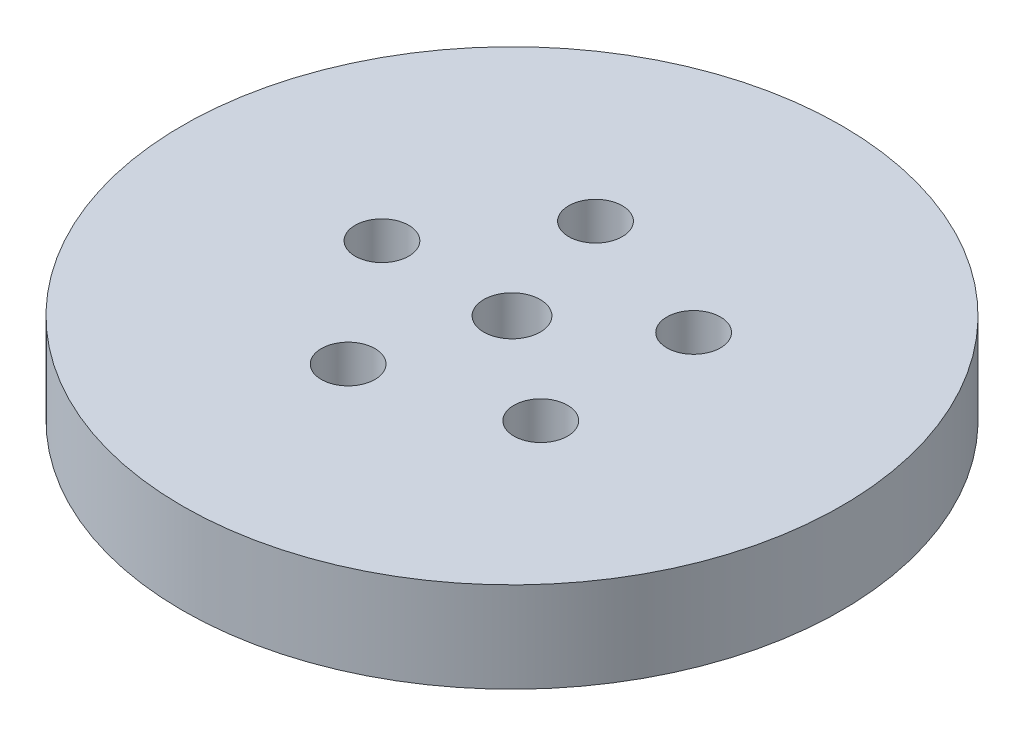
ISO-10303-21;
HEADER;
FILE_DESCRIPTION(('STEP AP214'),'2;1');
FILE_NAME('part.step','',(''),(''),'','','');
FILE_SCHEMA(('AUTOMOTIVE_DESIGN { 1 0 10303 214 1 1 1 1 }'));
ENDSEC;
DATA;
#1=APPLICATION_CONTEXT('core data for automotive mechanical design processes');
#2=APPLICATION_PROTOCOL_DEFINITION('international standard','automotive_design',2000,#1);
#3=PRODUCT_CONTEXT('',#1,'mechanical');
#4=PRODUCT('Part','Part','',(#3));
#5=PRODUCT_RELATED_PRODUCT_CATEGORY('part','',(#4));
#6=PRODUCT_DEFINITION_FORMATION('','',#4);
#7=PRODUCT_DEFINITION_CONTEXT('part definition',#1,'design');
#8=PRODUCT_DEFINITION('design','',#6,#7);
#9=PRODUCT_DEFINITION_SHAPE('','',#8);
#10=(LENGTH_UNIT() NAMED_UNIT(*) SI_UNIT(.MILLI.,.METRE.));
#11=(NAMED_UNIT(*) PLANE_ANGLE_UNIT() SI_UNIT($,.RADIAN.));
#12=(NAMED_UNIT(*) SI_UNIT($,.STERADIAN.) SOLID_ANGLE_UNIT());
#13=UNCERTAINTY_MEASURE_WITH_UNIT(LENGTH_MEASURE(1.E-05),#10,'distance_accuracy_value','');
#14=(GEOMETRIC_REPRESENTATION_CONTEXT(3) GLOBAL_UNCERTAINTY_ASSIGNED_CONTEXT((#13)) GLOBAL_UNIT_ASSIGNED_CONTEXT((#10,
#11,#12)) REPRESENTATION_CONTEXT('',''));
#15=CARTESIAN_POINT('',(0.,0.,0.));
#16=DIRECTION('',(0.,0.,1.));
#17=DIRECTION('',(1.,0.,0.));
#18=AXIS2_PLACEMENT_3D('',#15,#16,#17);
#19=CARTESIAN_POINT('',(0.,24.,0.));
#20=DIRECTION('',(0.,-1.,0.));
#21=DIRECTION('',(0.,0.,-1.));
#22=AXIS2_PLACEMENT_3D('',#19,#20,#21);
#23=CYLINDRICAL_SURFACE('',#22,87.5);
#24=CARTESIAN_POINT('',(0.,24.,0.));
#25=DIRECTION('',(0.,1.,0.));
#26=DIRECTION('',(0.,0.,1.));
#27=AXIS2_PLACEMENT_3D('',#24,#25,#26);
#28=CIRCLE('',#27,87.5);
#29=CARTESIAN_POINT('',(0.,24.,87.5));
#30=VERTEX_POINT('',#29);
#31=EDGE_CURVE('E10',#30,#30,#28,.T.);
#32=ORIENTED_EDGE('',*,*,#31,.F.);
#33=EDGE_LOOP('',(#32));
#34=FACE_BOUND('',#33,.T.);
#35=CARTESIAN_POINT('',(0.,0.,0.));
#36=DIRECTION('',(0.,1.,0.));
#37=DIRECTION('',(0.,0.,1.));
#38=AXIS2_PLACEMENT_3D('',#35,#36,#37);
#39=CIRCLE('',#38,87.5);
#40=CARTESIAN_POINT('',(0.,0.,87.5));
#41=VERTEX_POINT('',#40);
#42=EDGE_CURVE('E37',#41,#41,#39,.T.);
#43=ORIENTED_EDGE('',*,*,#42,.T.);
#44=EDGE_LOOP('',(#43));
#45=FACE_BOUND('',#44,.T.);
#46=ADVANCED_FACE('F40',(#34,#45),#23,.T.);
#47=CARTESIAN_POINT('',(0.,24.,0.));
#48=DIRECTION('',(0.,1.,0.));
#49=DIRECTION('',(0.,0.,1.));
#50=AXIS2_PLACEMENT_3D('',#47,#48,#49);
#51=PLANE('',#50);
#52=CARTESIAN_POINT('',(-10.6700276352967,24.,-32.8389683943563));
#53=DIRECTION('',(0.,1.,0.));
#54=DIRECTION('',(-0.95105651629515,0.,0.309016994374958));
#55=AXIS2_PLACEMENT_3D('',#52,#53,#54);
#56=CIRCLE('',#55,7.1207078960949);
#57=CARTESIAN_POINT('',(-17.442223280512,24.,-30.638548642483));
#58=VERTEX_POINT('',#57);
#59=EDGE_CURVE('E70',#58,#58,#56,.T.);
#60=ORIENTED_EDGE('',*,*,#59,.F.);
#61=EDGE_LOOP('',(#60));
#62=FACE_BOUND('',#61,.T.);
#63=CARTESIAN_POINT('',(27.9344950101062,24.,-20.2955986231961));
#64=DIRECTION('',(0.,1.,0.));
#65=DIRECTION('',(-0.58778525229248,0.,-0.809016994374942));
#66=AXIS2_PLACEMENT_3D('',#63,#64,#65);
#67=CIRCLE('',#66,7.1207078960949);
#68=CARTESIAN_POINT('',(23.749047922899,24.,-26.0563723231167));
#69=VERTEX_POINT('',#68);
#70=EDGE_CURVE('E71',#69,#69,#67,.T.);
#71=ORIENTED_EDGE('',*,*,#70,.F.);
#72=EDGE_LOOP('',(#71));
#73=FACE_BOUND('',#72,.T.);
#74=CARTESIAN_POINT('',(27.9344950101065,24.,20.2955986231957));
#75=DIRECTION('',(0.,1.,0.));
#76=DIRECTION('',(0.587785252292469,0.,-0.809016994374951));
#77=AXIS2_PLACEMENT_3D('',#74,#75,#76);
#78=CIRCLE('',#77,7.1207078960949);
#79=CARTESIAN_POINT('',(32.1199420973136,24.,14.534824923275));
#80=VERTEX_POINT('',#79);
#81=EDGE_CURVE('E78',#80,#80,#78,.T.);
#82=ORIENTED_EDGE('',*,*,#81,.F.);
#83=EDGE_LOOP('',(#82));
#84=FACE_BOUND('',#83,.T.);
#85=CARTESIAN_POINT('',(-10.6700276352962,24.,32.8389683943564));
#86=DIRECTION('',(0.,1.,0.));
#87=DIRECTION('',(0.951056516295155,0.,0.309016994374945));
#88=AXIS2_PLACEMENT_3D('',#85,#86,#87);
#89=CIRCLE('',#88,7.1207078960949);
#90=CARTESIAN_POINT('',(-3.89783199008079,24.,35.0393881462296));
#91=VERTEX_POINT('',#90);
#92=EDGE_CURVE('E61',#91,#91,#89,.T.);
#93=ORIENTED_EDGE('',*,*,#92,.F.);
#94=EDGE_LOOP('',(#93));
#95=FACE_BOUND('',#94,.T.);
#96=CARTESIAN_POINT('',(-34.5289347496201,24.,0.));
#97=DIRECTION('',(0.,1.,0.));
#98=DIRECTION('',(0.,0.,1.));
#99=AXIS2_PLACEMENT_3D('',#96,#97,#98);
#100=CIRCLE('',#99,7.1207078960949);
#101=CARTESIAN_POINT('',(-34.5289347496201,24.,7.1207078960949));
#102=VERTEX_POINT('',#101);
#103=EDGE_CURVE('E54',#102,#102,#100,.T.);
#104=ORIENTED_EDGE('',*,*,#103,.F.);
#105=EDGE_LOOP('',(#104));
#106=FACE_BOUND('',#105,.T.);
#107=CARTESIAN_POINT('',(0.,24.,0.));
#108=DIRECTION('',(0.,1.,0.));
#109=DIRECTION('',(0.,0.,1.));
#110=AXIS2_PLACEMENT_3D('',#107,#108,#109);
#111=CIRCLE('',#110,7.5);
#112=CARTESIAN_POINT('',(0.,24.,7.5));
#113=VERTEX_POINT('',#112);
#114=EDGE_CURVE('E50',#113,#113,#111,.T.);
#115=ORIENTED_EDGE('',*,*,#114,.F.);
#116=EDGE_LOOP('',(#115));
#117=FACE_BOUND('',#116,.T.);
#118=ORIENTED_EDGE('',*,*,#31,.T.);
#119=EDGE_LOOP('',(#118));
#120=FACE_BOUND('',#119,.T.);
#121=ADVANCED_FACE('F94',(#62,#73,#84,#95,#106,#117,#120),#51,.T.);
#122=CARTESIAN_POINT('',(0.,0.,0.));
#123=DIRECTION('',(0.,1.,0.));
#124=DIRECTION('',(0.,0.,1.));
#125=AXIS2_PLACEMENT_3D('',#122,#123,#124);
#126=PLANE('',#125);
#127=CARTESIAN_POINT('',(0.,0.,0.));
#128=DIRECTION('',(0.,1.,0.));
#129=DIRECTION('',(0.,0.,1.));
#130=AXIS2_PLACEMENT_3D('',#127,#128,#129);
#131=CIRCLE('',#130,7.5);
#132=CARTESIAN_POINT('',(0.,0.,7.5));
#133=VERTEX_POINT('',#132);
#134=EDGE_CURVE('E47',#133,#133,#131,.T.);
#135=ORIENTED_EDGE('',*,*,#134,.T.);
#136=EDGE_LOOP('',(#135));
#137=FACE_BOUND('',#136,.T.);
#138=ORIENTED_EDGE('',*,*,#42,.F.);
#139=EDGE_LOOP('',(#138));
#140=FACE_BOUND('',#139,.T.);
#141=ADVANCED_FACE('F100',(#137,#140),#126,.F.);
#142=CARTESIAN_POINT('',(0.,24.,0.));
#143=DIRECTION('',(0.,-1.,0.));
#144=DIRECTION('',(0.,0.,-1.));
#145=AXIS2_PLACEMENT_3D('',#142,#143,#144);
#146=CYLINDRICAL_SURFACE('',#145,7.5);
#147=ORIENTED_EDGE('',*,*,#114,.T.);
#148=EDGE_LOOP('',(#147));
#149=FACE_BOUND('',#148,.T.);
#150=ORIENTED_EDGE('',*,*,#134,.F.);
#151=EDGE_LOOP('',(#150));
#152=FACE_BOUND('',#151,.T.);
#153=ADVANCED_FACE('F106',(#149,#152),#146,.F.);
#154=CARTESIAN_POINT('',(-34.5289347496201,1.681451558427,0.));
#155=DIRECTION('',(0.,1.,0.));
#156=DIRECTION('',(0.,0.,1.));
#157=AXIS2_PLACEMENT_3D('',#154,#155,#156);
#158=CYLINDRICAL_SURFACE('',#157,7.1207078960949);
#159=CARTESIAN_POINT('',(-34.5289347496201,1.681451558427,0.));
#160=DIRECTION('',(0.,1.,0.));
#161=DIRECTION('',(0.,0.,1.));
#162=AXIS2_PLACEMENT_3D('',#159,#160,#161);
#163=CIRCLE('',#162,7.1207078960949);
#164=CARTESIAN_POINT('',(-34.5289347496201,1.681451558427,7.1207078960949));
#165=VERTEX_POINT('',#164);
#166=EDGE_CURVE('E55',#165,#165,#163,.T.);
#167=ORIENTED_EDGE('',*,*,#166,.F.);
#168=EDGE_LOOP('',(#167));
#169=FACE_BOUND('',#168,.T.);
#170=ORIENTED_EDGE('',*,*,#103,.T.);
#171=EDGE_LOOP('',(#170));
#172=FACE_BOUND('',#171,.T.);
#173=ADVANCED_FACE('F108',(#169,#172),#158,.F.);
#174=CARTESIAN_POINT('',(-34.5289347496201,1.681451558427,0.));
#175=DIRECTION('',(0.,1.,0.));
#176=DIRECTION('',(0.,0.,1.));
#177=AXIS2_PLACEMENT_3D('',#174,#175,#176);
#178=PLANE('',#177);
#179=ORIENTED_EDGE('',*,*,#166,.T.);
#180=EDGE_LOOP('',(#179));
#181=FACE_BOUND('',#180,.T.);
#182=ADVANCED_FACE('F138',(#181),#178,.T.);
#183=CARTESIAN_POINT('',(-10.6700276352962,1.681451558427,32.8389683943564));
#184=DIRECTION('',(0.,1.,0.));
#185=DIRECTION('',(0.,0.,1.));
#186=AXIS2_PLACEMENT_3D('',#183,#184,#185);
#187=CYLINDRICAL_SURFACE('',#186,7.1207078960949);
#188=CARTESIAN_POINT('',(-10.6700276352962,1.681451558427,32.8389683943564));
#189=DIRECTION('',(0.,1.,0.));
#190=DIRECTION('',(0.951056516295155,0.,0.309016994374945));
#191=AXIS2_PLACEMENT_3D('',#188,#189,#190);
#192=CIRCLE('',#191,7.1207078960949);
#193=CARTESIAN_POINT('',(-3.89783199008079,1.681451558427,35.0393881462296));
#194=VERTEX_POINT('',#193);
#195=EDGE_CURVE('E59',#194,#194,#192,.T.);
#196=ORIENTED_EDGE('',*,*,#195,.F.);
#197=EDGE_LOOP('',(#196));
#198=FACE_BOUND('',#197,.T.);
#199=ORIENTED_EDGE('',*,*,#92,.T.);
#200=EDGE_LOOP('',(#199));
#201=FACE_BOUND('',#200,.T.);
#202=ADVANCED_FACE('F150',(#198,#201),#187,.F.);
#203=CARTESIAN_POINT('',(-10.6700276352962,1.681451558427,32.8389683943564));
#204=DIRECTION('',(0.,1.,0.));
#205=DIRECTION('',(0.951056516295155,0.,0.309016994374945));
#206=AXIS2_PLACEMENT_3D('',#203,#204,#205);
#207=PLANE('',#206);
#208=ORIENTED_EDGE('',*,*,#195,.T.);
#209=EDGE_LOOP('',(#208));
#210=FACE_BOUND('',#209,.T.);
#211=ADVANCED_FACE('F89',(#210),#207,.T.);
#212=CARTESIAN_POINT('',(27.9344950101065,1.681451558427,20.2955986231957));
#213=DIRECTION('',(0.,1.,0.));
#214=DIRECTION('',(0.,0.,1.));
#215=AXIS2_PLACEMENT_3D('',#212,#213,#214);
#216=CYLINDRICAL_SURFACE('',#215,7.1207078960949);
#217=CARTESIAN_POINT('',(27.9344950101065,1.681451558427,20.2955986231957));
#218=DIRECTION('',(0.,1.,0.));
#219=DIRECTION('',(0.587785252292469,0.,-0.809016994374951));
#220=AXIS2_PLACEMENT_3D('',#217,#218,#219);
#221=CIRCLE('',#220,7.1207078960949);
#222=CARTESIAN_POINT('',(32.1199420973136,1.681451558427,14.534824923275));
#223=VERTEX_POINT('',#222);
#224=EDGE_CURVE('E63',#223,#223,#221,.T.);
#225=ORIENTED_EDGE('',*,*,#224,.F.);
#226=EDGE_LOOP('',(#225));
#227=FACE_BOUND('',#226,.T.);
#228=ORIENTED_EDGE('',*,*,#81,.T.);
#229=EDGE_LOOP('',(#228));
#230=FACE_BOUND('',#229,.T.);
#231=ADVANCED_FACE('F87',(#227,#230),#216,.F.);
#232=CARTESIAN_POINT('',(27.9344950101065,1.681451558427,20.2955986231957));
#233=DIRECTION('',(0.,1.,0.));
#234=DIRECTION('',(0.587785252292469,0.,-0.809016994374951));
#235=AXIS2_PLACEMENT_3D('',#232,#233,#234);
#236=PLANE('',#235);
#237=ORIENTED_EDGE('',*,*,#224,.T.);
#238=EDGE_LOOP('',(#237));
#239=FACE_BOUND('',#238,.T.);
#240=ADVANCED_FACE('F84',(#239),#236,.T.);
#241=CARTESIAN_POINT('',(27.9344950101062,1.681451558427,-20.2955986231961));
#242=DIRECTION('',(0.,1.,0.));
#243=DIRECTION('',(0.,0.,1.));
#244=AXIS2_PLACEMENT_3D('',#241,#242,#243);
#245=CYLINDRICAL_SURFACE('',#244,7.1207078960949);
#246=CARTESIAN_POINT('',(27.9344950101062,1.681451558427,-20.2955986231961));
#247=DIRECTION('',(0.,1.,0.));
#248=DIRECTION('',(-0.58778525229248,0.,-0.809016994374942));
#249=AXIS2_PLACEMENT_3D('',#246,#247,#248);
#250=CIRCLE('',#249,7.1207078960949);
#251=CARTESIAN_POINT('',(23.749047922899,1.681451558427,-26.0563723231167));
#252=VERTEX_POINT('',#251);
#253=EDGE_CURVE('E76',#252,#252,#250,.T.);
#254=ORIENTED_EDGE('',*,*,#253,.F.);
#255=EDGE_LOOP('',(#254));
#256=FACE_BOUND('',#255,.T.);
#257=ORIENTED_EDGE('',*,*,#70,.T.);
#258=EDGE_LOOP('',(#257));
#259=FACE_BOUND('',#258,.T.);
#260=ADVANCED_FACE('F185',(#256,#259),#245,.F.);
#261=CARTESIAN_POINT('',(27.9344950101062,1.681451558427,-20.2955986231961));
#262=DIRECTION('',(0.,1.,0.));
#263=DIRECTION('',(-0.58778525229248,0.,-0.809016994374942));
#264=AXIS2_PLACEMENT_3D('',#261,#262,#263);
#265=PLANE('',#264);
#266=ORIENTED_EDGE('',*,*,#253,.T.);
#267=EDGE_LOOP('',(#266));
#268=FACE_BOUND('',#267,.T.);
#269=ADVANCED_FACE('F189',(#268),#265,.T.);
#270=CARTESIAN_POINT('',(-10.6700276352967,1.681451558427,-32.8389683943563));
#271=DIRECTION('',(0.,1.,0.));
#272=DIRECTION('',(0.,0.,1.));
#273=AXIS2_PLACEMENT_3D('',#270,#271,#272);
#274=CYLINDRICAL_SURFACE('',#273,7.1207078960949);
#275=CARTESIAN_POINT('',(-10.6700276352967,1.681451558427,-32.8389683943563));
#276=DIRECTION('',(0.,1.,0.));
#277=DIRECTION('',(-0.95105651629515,0.,0.309016994374958));
#278=AXIS2_PLACEMENT_3D('',#275,#276,#277);
#279=CIRCLE('',#278,7.1207078960949);
#280=CARTESIAN_POINT('',(-17.442223280512,1.681451558427,-30.638548642483));
#281=VERTEX_POINT('',#280);
#282=EDGE_CURVE('E69',#281,#281,#279,.T.);
#283=ORIENTED_EDGE('',*,*,#282,.F.);
#284=EDGE_LOOP('',(#283));
#285=FACE_BOUND('',#284,.T.);
#286=ORIENTED_EDGE('',*,*,#59,.T.);
#287=EDGE_LOOP('',(#286));
#288=FACE_BOUND('',#287,.T.);
#289=ADVANCED_FACE('F200',(#285,#288),#274,.F.);
#290=CARTESIAN_POINT('',(-10.6700276352967,1.681451558427,-32.8389683943563));
#291=DIRECTION('',(0.,1.,0.));
#292=DIRECTION('',(-0.95105651629515,0.,0.309016994374958));
#293=AXIS2_PLACEMENT_3D('',#290,#291,#292);
#294=PLANE('',#293);
#295=ORIENTED_EDGE('',*,*,#282,.T.);
#296=EDGE_LOOP('',(#295));
#297=FACE_BOUND('',#296,.T.);
#298=ADVANCED_FACE('F208',(#297),#294,.T.);
#299=CLOSED_SHELL('',(#46,#121,#141,#153,#173,#182,#202,#211,#231,#240,#260,#269,#289,#298));
#300=MANIFOLD_SOLID_BREP('B2',#299);
#301=ADVANCED_BREP_SHAPE_REPRESENTATION('',(#18,#300),#14);
#302=SHAPE_DEFINITION_REPRESENTATION(#9,#301);
ENDSEC;
END-ISO-10303-21;
